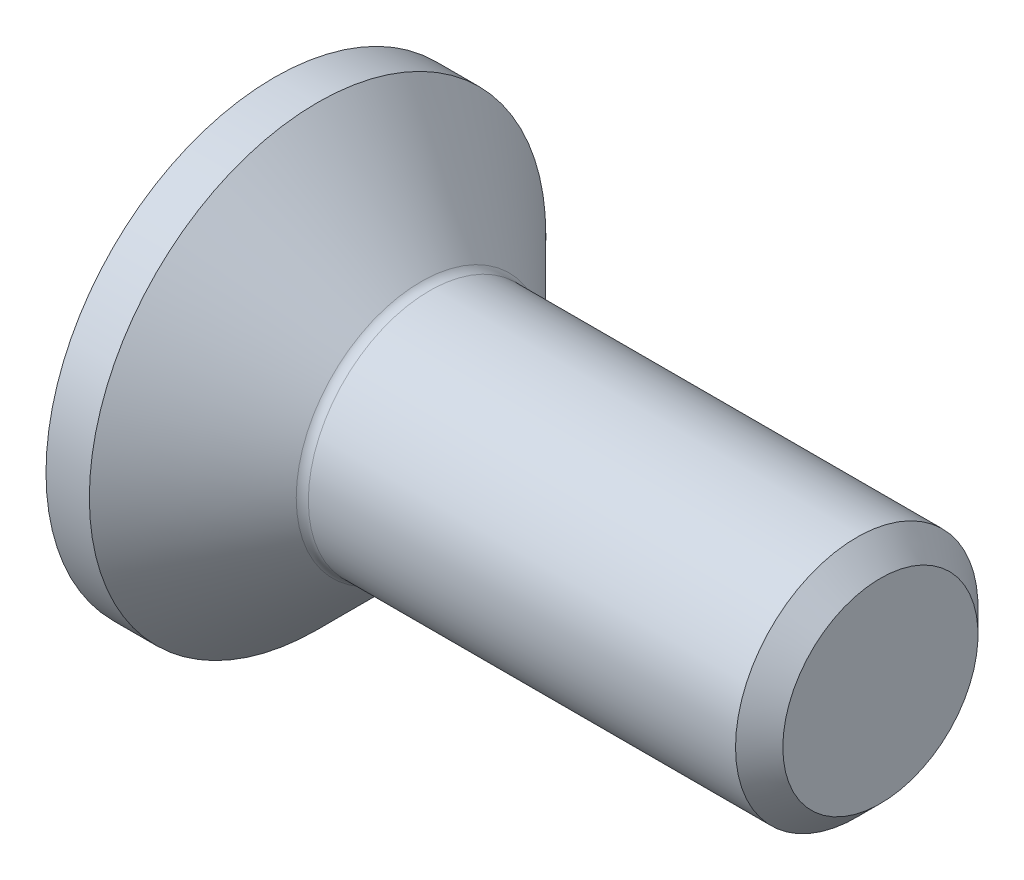
ISO-10303-21;
HEADER;
FILE_DESCRIPTION(('STEP AP214'),'2;1');
FILE_NAME('part.step','',(''),(''),'','','');
FILE_SCHEMA(('AUTOMOTIVE_DESIGN { 1 0 10303 214 1 1 1 1 }'));
ENDSEC;
DATA;
#1=APPLICATION_CONTEXT('core data for automotive mechanical design processes');
#2=APPLICATION_PROTOCOL_DEFINITION('international standard','automotive_design',2000,#1);
#3=PRODUCT_CONTEXT('',#1,'mechanical');
#4=PRODUCT('Part','Part','',(#3));
#5=PRODUCT_RELATED_PRODUCT_CATEGORY('part','',(#4));
#6=PRODUCT_DEFINITION_FORMATION('','',#4);
#7=PRODUCT_DEFINITION_CONTEXT('part definition',#1,'design');
#8=PRODUCT_DEFINITION('design','',#6,#7);
#9=PRODUCT_DEFINITION_SHAPE('','',#8);
#10=(LENGTH_UNIT() NAMED_UNIT(*) SI_UNIT(.MILLI.,.METRE.));
#11=(NAMED_UNIT(*) PLANE_ANGLE_UNIT() SI_UNIT($,.RADIAN.));
#12=(NAMED_UNIT(*) SI_UNIT($,.STERADIAN.) SOLID_ANGLE_UNIT());
#13=UNCERTAINTY_MEASURE_WITH_UNIT(LENGTH_MEASURE(1.E-05),#10,'distance_accuracy_value','');
#14=(GEOMETRIC_REPRESENTATION_CONTEXT(3) GLOBAL_UNCERTAINTY_ASSIGNED_CONTEXT((#13)) GLOBAL_UNIT_ASSIGNED_CONTEXT((#10,
#11,#12)) REPRESENTATION_CONTEXT('',''));
#15=CARTESIAN_POINT('',(0.,0.,0.));
#16=DIRECTION('',(0.,0.,1.));
#17=DIRECTION('',(1.,0.,0.));
#18=AXIS2_PLACEMENT_3D('',#15,#16,#17);
#19=CARTESIAN_POINT('',(0.,0.,0.));
#20=DIRECTION('',(-1.,0.,0.));
#21=DIRECTION('',(0.,0.,1.));
#22=AXIS2_PLACEMENT_3D('',#19,#20,#21);
#23=PLANE('',#22);
#24=CARTESIAN_POINT('',(0.,0.,0.));
#25=DIRECTION('',(-1.,0.,0.));
#26=DIRECTION('',(0.,0.,1.));
#27=AXIS2_PLACEMENT_3D('',#24,#25,#26);
#28=CIRCLE('',#27,3.765);
#29=CARTESIAN_POINT('',(0.,0.,3.765));
#30=VERTEX_POINT('',#29);
#31=EDGE_CURVE('E167',#30,#30,#28,.T.);
#32=ORIENTED_EDGE('',*,*,#31,.T.);
#33=EDGE_LOOP('',(#32));
#34=FACE_BOUND('',#33,.T.);
#35=DIRECTION('',(0.,-0.500000000000001,-0.866025403784438));
#36=VECTOR('',#35,1.);
#37=CARTESIAN_POINT('',(0.,-0.721687836487031,1.25));
#38=LINE('',#37,#36);
#39=CARTESIAN_POINT('',(0.,-0.721687836487031,1.25));
#40=VERTEX_POINT('',#39);
#41=CARTESIAN_POINT('',(0.,-1.44337567297407,0.));
#42=VERTEX_POINT('',#41);
#43=EDGE_CURVE('E123',#40,#42,#38,.T.);
#44=ORIENTED_EDGE('',*,*,#43,.T.);
#45=DIRECTION('',(0.,0.5,-0.866025403784438));
#46=VECTOR('',#45,1.);
#47=CARTESIAN_POINT('',(0.,-1.44337567297407,0.));
#48=LINE('',#47,#46);
#49=CARTESIAN_POINT('',(0.,-0.721687836487032,-1.25));
#50=VERTEX_POINT('',#49);
#51=EDGE_CURVE('E41',#42,#50,#48,.T.);
#52=ORIENTED_EDGE('',*,*,#51,.T.);
#53=DIRECTION('',(0.,1.,0.));
#54=VECTOR('',#53,1.);
#55=CARTESIAN_POINT('',(0.,-0.721687836487032,-1.25));
#56=LINE('',#55,#54);
#57=CARTESIAN_POINT('',(0.,0.721687836487033,-1.25));
#58=VERTEX_POINT('',#57);
#59=EDGE_CURVE('E104',#50,#58,#56,.T.);
#60=ORIENTED_EDGE('',*,*,#59,.T.);
#61=DIRECTION('',(0.,0.500000000000001,0.866025403784438));
#62=VECTOR('',#61,1.);
#63=CARTESIAN_POINT('',(0.,0.721687836487033,-1.25));
#64=LINE('',#63,#62);
#65=CARTESIAN_POINT('',(0.,1.44337567297407,0.));
#66=VERTEX_POINT('',#65);
#67=EDGE_CURVE('E112',#58,#66,#64,.T.);
#68=ORIENTED_EDGE('',*,*,#67,.T.);
#69=DIRECTION('',(0.,-0.5,0.866025403784439));
#70=VECTOR('',#69,1.);
#71=CARTESIAN_POINT('',(0.,1.44337567297407,0.));
#72=LINE('',#71,#70);
#73=CARTESIAN_POINT('',(0.,0.721687836487033,1.25));
#74=VERTEX_POINT('',#73);
#75=EDGE_CURVE('E127',#66,#74,#72,.T.);
#76=ORIENTED_EDGE('',*,*,#75,.T.);
#77=DIRECTION('',(0.,-1.,0.));
#78=VECTOR('',#77,1.);
#79=CARTESIAN_POINT('',(0.,0.721687836487033,1.25));
#80=LINE('',#79,#78);
#81=EDGE_CURVE('E130',#74,#40,#80,.T.);
#82=ORIENTED_EDGE('',*,*,#81,.T.);
#83=EDGE_LOOP('',(#44,#52,#60,#68,#76,#82));
#84=FACE_BOUND('',#83,.T.);
#85=ADVANCED_FACE('F26',(#34,#84),#23,.T.);
#86=CARTESIAN_POINT('',(9.99999999999999,1.61,0.));
#87=DIRECTION('',(1.,0.,0.));
#88=DIRECTION('',(0.,0.,-1.));
#89=AXIS2_PLACEMENT_3D('',#86,#87,#88);
#90=PLANE('',#89);
#91=CARTESIAN_POINT('',(9.99999999999999,0.,0.));
#92=DIRECTION('',(-1.,0.,0.));
#93=DIRECTION('',(0.,0.,1.));
#94=AXIS2_PLACEMENT_3D('',#91,#92,#93);
#95=CIRCLE('',#94,1.61);
#96=CARTESIAN_POINT('',(9.99999999999999,0.,1.61));
#97=VERTEX_POINT('',#96);
#98=EDGE_CURVE('E177',#97,#97,#95,.T.);
#99=ORIENTED_EDGE('',*,*,#98,.F.);
#100=EDGE_LOOP('',(#99));
#101=FACE_BOUND('',#100,.T.);
#102=ADVANCED_FACE('F28',(#101),#90,.T.);
#103=CARTESIAN_POINT('',(9.99999999999999,0.,0.));
#104=DIRECTION('',(-1.,0.,0.));
#105=DIRECTION('',(0.,0.,1.));
#106=AXIS2_PLACEMENT_3D('',#103,#104,#105);
#107=CONICAL_SURFACE('',#106,1.61,0.785398163397446);
#108=CARTESIAN_POINT('',(9.60999999999999,0.,0.));
#109=DIRECTION('',(-1.,0.,0.));
#110=DIRECTION('',(0.,0.,1.));
#111=AXIS2_PLACEMENT_3D('',#108,#109,#110);
#112=CIRCLE('',#111,2.);
#113=CARTESIAN_POINT('',(9.60999999999999,0.,2.));
#114=VERTEX_POINT('',#113);
#115=EDGE_CURVE('E174',#114,#114,#112,.T.);
#116=ORIENTED_EDGE('',*,*,#115,.F.);
#117=EDGE_LOOP('',(#116));
#118=FACE_BOUND('',#117,.T.);
#119=ORIENTED_EDGE('',*,*,#98,.T.);
#120=EDGE_LOOP('',(#119));
#121=FACE_BOUND('',#120,.T.);
#122=ADVANCED_FACE('F206',(#118,#121),#107,.T.);
#123=CARTESIAN_POINT('',(0.,0.,0.));
#124=DIRECTION('',(-1.,0.,0.));
#125=DIRECTION('',(0.,0.,1.));
#126=AXIS2_PLACEMENT_3D('',#123,#124,#125);
#127=CYLINDRICAL_SURFACE('',#126,2.);
#128=CARTESIAN_POINT('',(2.56284271247462,0.,0.));
#129=DIRECTION('',(-1.,0.,0.));
#130=DIRECTION('',(0.,0.,1.));
#131=AXIS2_PLACEMENT_3D('',#128,#129,#130);
#132=CIRCLE('',#131,2.);
#133=CARTESIAN_POINT('',(2.56284271247462,0.,2.));
#134=VERTEX_POINT('',#133);
#135=EDGE_CURVE('E11',#134,#134,#132,.F.);
#136=ORIENTED_EDGE('',*,*,#135,.T.);
#137=EDGE_LOOP('',(#136));
#138=FACE_BOUND('',#137,.T.);
#139=ORIENTED_EDGE('',*,*,#115,.T.);
#140=EDGE_LOOP('',(#139));
#141=FACE_BOUND('',#140,.T.);
#142=ADVANCED_FACE('F210',(#138,#141),#127,.T.);
#143=CARTESIAN_POINT('',(0.71500000000001,0.,0.));
#144=DIRECTION('',(-1.,0.,0.));
#145=DIRECTION('',(0.,0.,1.));
#146=AXIS2_PLACEMENT_3D('',#143,#144,#145);
#147=CONICAL_SURFACE('',#146,3.765,0.785398163397451);
#148=CARTESIAN_POINT('',(2.42142135623731,0.,0.));
#149=DIRECTION('',(-1.,0.,0.));
#150=DIRECTION('',(0.,0.,1.));
#151=AXIS2_PLACEMENT_3D('',#148,#149,#150);
#152=CIRCLE('',#151,2.05857864376269);
#153=CARTESIAN_POINT('',(2.42142135623731,0.,2.05857864376269));
#154=VERTEX_POINT('',#153);
#155=EDGE_CURVE('E34',#154,#154,#152,.T.);
#156=ORIENTED_EDGE('',*,*,#155,.T.);
#157=EDGE_LOOP('',(#156));
#158=FACE_BOUND('',#157,.T.);
#159=CARTESIAN_POINT('',(0.71500000000001,0.,0.));
#160=DIRECTION('',(-1.,0.,0.));
#161=DIRECTION('',(0.,0.,1.));
#162=AXIS2_PLACEMENT_3D('',#159,#160,#161);
#163=CIRCLE('',#162,3.765);
#164=CARTESIAN_POINT('',(0.71500000000001,0.,3.765));
#165=VERTEX_POINT('',#164);
#166=EDGE_CURVE('E171',#165,#165,#163,.T.);
#167=ORIENTED_EDGE('',*,*,#166,.F.);
#168=EDGE_LOOP('',(#167));
#169=FACE_BOUND('',#168,.T.);
#170=ADVANCED_FACE('F182',(#158,#169),#147,.T.);
#171=CARTESIAN_POINT('',(0.,0.,0.));
#172=DIRECTION('',(-1.,0.,0.));
#173=DIRECTION('',(0.,0.,1.));
#174=AXIS2_PLACEMENT_3D('',#171,#172,#173);
#175=CYLINDRICAL_SURFACE('',#174,3.765);
#176=ORIENTED_EDGE('',*,*,#166,.T.);
#177=EDGE_LOOP('',(#176));
#178=FACE_BOUND('',#177,.T.);
#179=ORIENTED_EDGE('',*,*,#31,.F.);
#180=EDGE_LOOP('',(#179));
#181=FACE_BOUND('',#180,.T.);
#182=ADVANCED_FACE('F187',(#178,#181),#175,.T.);
#183=CARTESIAN_POINT('',(2.56284271247462,0.,0.));
#184=DIRECTION('',(-1.,0.,0.));
#185=DIRECTION('',(0.,0.,1.));
#186=AXIS2_PLACEMENT_3D('',#183,#184,#185);
#187=TOROIDAL_SURFACE('',#186,2.2,0.2);
#188=ORIENTED_EDGE('',*,*,#135,.F.);
#189=EDGE_LOOP('',(#188));
#190=FACE_BOUND('',#189,.T.);
#191=ORIENTED_EDGE('',*,*,#155,.F.);
#192=EDGE_LOOP('',(#191));
#193=FACE_BOUND('',#192,.T.);
#194=ADVANCED_FACE('F185',(#190,#193),#187,.F.);
#195=CARTESIAN_POINT('',(1.5,-1.44337567297407,0.));
#196=DIRECTION('',(0.,0.866025403784438,0.500000000000001));
#197=DIRECTION('',(0.,-0.500000000000001,0.866025403784438));
#198=AXIS2_PLACEMENT_3D('',#195,#196,#197);
#199=PLANE('',#198);
#200=ORIENTED_EDGE('',*,*,#51,.F.);
#201=DIRECTION('',(-1.,0.,0.));
#202=VECTOR('',#201,1.);
#203=CARTESIAN_POINT('',(1.5,-1.44337567297407,0.));
#204=LINE('',#203,#202);
#205=CARTESIAN_POINT('',(1.5,-1.44337567297407,0.));
#206=VERTEX_POINT('',#205);
#207=EDGE_CURVE('E152',#206,#42,#204,.T.);
#208=ORIENTED_EDGE('',*,*,#207,.F.);
#209=DIRECTION('',(0.,0.5,-0.866025403784438));
#210=VECTOR('',#209,1.);
#211=CARTESIAN_POINT('',(1.5,-1.44337567297407,0.));
#212=LINE('',#211,#210);
#213=CARTESIAN_POINT('',(1.5,-1.08253175473055,-0.625000000000001));
#214=VERTEX_POINT('',#213);
#215=EDGE_CURVE('E133',#206,#214,#212,.T.);
#216=ORIENTED_EDGE('',*,*,#215,.T.);
#217=CARTESIAN_POINT('',(1.5,-0.721687836487032,-1.25));
#218=VERTEX_POINT('',#217);
#219=EDGE_CURVE('E117',#214,#218,#212,.T.);
#220=ORIENTED_EDGE('',*,*,#219,.T.);
#221=DIRECTION('',(-1.,0.,0.));
#222=VECTOR('',#221,1.);
#223=CARTESIAN_POINT('',(1.5,-0.721687836487032,-1.25));
#224=LINE('',#223,#222);
#225=EDGE_CURVE('E107',#218,#50,#224,.T.);
#226=ORIENTED_EDGE('',*,*,#225,.T.);
#227=EDGE_LOOP('',(#200,#208,#216,#220,#226));
#228=FACE_BOUND('',#227,.T.);
#229=ADVANCED_FACE('F114',(#228),#199,.T.);
#230=CARTESIAN_POINT('',(1.5,-0.721687836487032,-1.25));
#231=DIRECTION('',(0.,0.,1.));
#232=DIRECTION('',(0.,-1.,0.));
#233=AXIS2_PLACEMENT_3D('',#230,#231,#232);
#234=PLANE('',#233);
#235=ORIENTED_EDGE('',*,*,#59,.F.);
#236=ORIENTED_EDGE('',*,*,#225,.F.);
#237=DIRECTION('',(0.,1.,0.));
#238=VECTOR('',#237,1.);
#239=CARTESIAN_POINT('',(1.5,-0.721687836487032,-1.25));
#240=LINE('',#239,#238);
#241=CARTESIAN_POINT('',(1.5,0.,-1.25));
#242=VERTEX_POINT('',#241);
#243=EDGE_CURVE('E136',#218,#242,#240,.T.);
#244=ORIENTED_EDGE('',*,*,#243,.T.);
#245=CARTESIAN_POINT('',(1.5,0.721687836487033,-1.25));
#246=VERTEX_POINT('',#245);
#247=EDGE_CURVE('E135',#242,#246,#240,.T.);
#248=ORIENTED_EDGE('',*,*,#247,.T.);
#249=DIRECTION('',(-1.,0.,0.));
#250=VECTOR('',#249,1.);
#251=CARTESIAN_POINT('',(1.5,0.721687836487033,-1.25));
#252=LINE('',#251,#250);
#253=EDGE_CURVE('E109',#246,#58,#252,.T.);
#254=ORIENTED_EDGE('',*,*,#253,.T.);
#255=EDGE_LOOP('',(#235,#236,#244,#248,#254));
#256=FACE_BOUND('',#255,.T.);
#257=ADVANCED_FACE('F105',(#256),#234,.T.);
#258=CARTESIAN_POINT('',(1.5,0.721687836487033,-1.25));
#259=DIRECTION('',(0.,-0.866025403784438,0.5));
#260=DIRECTION('',(0.,-0.500000000000001,-0.866025403784438));
#261=AXIS2_PLACEMENT_3D('',#258,#259,#260);
#262=PLANE('',#261);
#263=ORIENTED_EDGE('',*,*,#67,.F.);
#264=ORIENTED_EDGE('',*,*,#253,.F.);
#265=DIRECTION('',(0.,0.500000000000001,0.866025403784438));
#266=VECTOR('',#265,1.);
#267=CARTESIAN_POINT('',(1.5,0.721687836487033,-1.25));
#268=LINE('',#267,#266);
#269=CARTESIAN_POINT('',(1.5,1.08253175473055,-0.625000000000001));
#270=VERTEX_POINT('',#269);
#271=EDGE_CURVE('E139',#246,#270,#268,.T.);
#272=ORIENTED_EDGE('',*,*,#271,.T.);
#273=CARTESIAN_POINT('',(1.5,1.44337567297407,0.));
#274=VERTEX_POINT('',#273);
#275=EDGE_CURVE('E138',#270,#274,#268,.T.);
#276=ORIENTED_EDGE('',*,*,#275,.T.);
#277=DIRECTION('',(-1.,0.,0.));
#278=VECTOR('',#277,1.);
#279=CARTESIAN_POINT('',(1.5,1.44337567297407,0.));
#280=LINE('',#279,#278);
#281=EDGE_CURVE('E160',#274,#66,#280,.T.);
#282=ORIENTED_EDGE('',*,*,#281,.T.);
#283=EDGE_LOOP('',(#263,#264,#272,#276,#282));
#284=FACE_BOUND('',#283,.T.);
#285=ADVANCED_FACE('F259',(#284),#262,.T.);
#286=CARTESIAN_POINT('',(1.5,1.44337567297407,0.));
#287=DIRECTION('',(0.,-0.866025403784439,-0.5));
#288=DIRECTION('',(0.,0.5,-0.866025403784439));
#289=AXIS2_PLACEMENT_3D('',#286,#287,#288);
#290=PLANE('',#289);
#291=ORIENTED_EDGE('',*,*,#75,.F.);
#292=ORIENTED_EDGE('',*,*,#281,.F.);
#293=DIRECTION('',(0.,-0.5,0.866025403784439));
#294=VECTOR('',#293,1.);
#295=CARTESIAN_POINT('',(1.5,1.44337567297407,0.));
#296=LINE('',#295,#294);
#297=CARTESIAN_POINT('',(1.5,1.08253175473055,0.625));
#298=VERTEX_POINT('',#297);
#299=EDGE_CURVE('E49',#274,#298,#296,.T.);
#300=ORIENTED_EDGE('',*,*,#299,.T.);
#301=CARTESIAN_POINT('',(1.5,0.721687836487033,1.25));
#302=VERTEX_POINT('',#301);
#303=EDGE_CURVE('E142',#298,#302,#296,.T.);
#304=ORIENTED_EDGE('',*,*,#303,.T.);
#305=DIRECTION('',(-1.,0.,0.));
#306=VECTOR('',#305,1.);
#307=CARTESIAN_POINT('',(1.5,0.721687836487033,1.25));
#308=LINE('',#307,#306);
#309=EDGE_CURVE('E157',#302,#74,#308,.T.);
#310=ORIENTED_EDGE('',*,*,#309,.T.);
#311=EDGE_LOOP('',(#291,#292,#300,#304,#310));
#312=FACE_BOUND('',#311,.T.);
#313=ADVANCED_FACE('F266',(#312),#290,.T.);
#314=CARTESIAN_POINT('',(1.5,0.721687836487033,1.25));
#315=DIRECTION('',(0.,0.,-1.));
#316=DIRECTION('',(0.,1.,0.));
#317=AXIS2_PLACEMENT_3D('',#314,#315,#316);
#318=PLANE('',#317);
#319=ORIENTED_EDGE('',*,*,#81,.F.);
#320=ORIENTED_EDGE('',*,*,#309,.F.);
#321=DIRECTION('',(0.,-1.,0.));
#322=VECTOR('',#321,1.);
#323=CARTESIAN_POINT('',(1.5,0.721687836487033,1.25));
#324=LINE('',#323,#322);
#325=CARTESIAN_POINT('',(1.5,0.,1.25));
#326=VERTEX_POINT('',#325);
#327=EDGE_CURVE('E145',#302,#326,#324,.T.);
#328=ORIENTED_EDGE('',*,*,#327,.T.);
#329=CARTESIAN_POINT('',(1.5,-0.721687836487031,1.25));
#330=VERTEX_POINT('',#329);
#331=EDGE_CURVE('E144',#326,#330,#324,.T.);
#332=ORIENTED_EDGE('',*,*,#331,.T.);
#333=DIRECTION('',(-1.,0.,0.));
#334=VECTOR('',#333,1.);
#335=CARTESIAN_POINT('',(1.5,-0.721687836487031,1.25));
#336=LINE('',#335,#334);
#337=EDGE_CURVE('E154',#330,#40,#336,.T.);
#338=ORIENTED_EDGE('',*,*,#337,.T.);
#339=EDGE_LOOP('',(#319,#320,#328,#332,#338));
#340=FACE_BOUND('',#339,.T.);
#341=ADVANCED_FACE('F274',(#340),#318,.T.);
#342=CARTESIAN_POINT('',(1.5,-0.721687836487031,1.25));
#343=DIRECTION('',(0.,0.866025403784438,-0.500000000000001));
#344=DIRECTION('',(0.,0.500000000000001,0.866025403784438));
#345=AXIS2_PLACEMENT_3D('',#342,#343,#344);
#346=PLANE('',#345);
#347=ORIENTED_EDGE('',*,*,#43,.F.);
#348=ORIENTED_EDGE('',*,*,#337,.F.);
#349=DIRECTION('',(0.,-0.500000000000001,-0.866025403784438));
#350=VECTOR('',#349,1.);
#351=CARTESIAN_POINT('',(1.5,-0.721687836487031,1.25));
#352=LINE('',#351,#350);
#353=CARTESIAN_POINT('',(1.5,-1.08253175473055,0.625000000000002));
#354=VERTEX_POINT('',#353);
#355=EDGE_CURVE('E149',#330,#354,#352,.T.);
#356=ORIENTED_EDGE('',*,*,#355,.T.);
#357=EDGE_CURVE('E148',#354,#206,#352,.T.);
#358=ORIENTED_EDGE('',*,*,#357,.T.);
#359=ORIENTED_EDGE('',*,*,#207,.T.);
#360=EDGE_LOOP('',(#347,#348,#356,#358,#359));
#361=FACE_BOUND('',#360,.T.);
#362=ADVANCED_FACE('F281',(#361),#346,.T.);
#363=CARTESIAN_POINT('',(1.5,-1.44337567297407,0.));
#364=DIRECTION('',(-1.,0.,0.));
#365=DIRECTION('',(0.,0.,1.));
#366=AXIS2_PLACEMENT_3D('',#363,#364,#365);
#367=PLANE('',#366);
#368=CARTESIAN_POINT('',(1.5,0.,0.));
#369=DIRECTION('',(-1.,0.,0.));
#370=DIRECTION('',(0.,0.,1.));
#371=AXIS2_PLACEMENT_3D('',#368,#369,#370);
#372=CIRCLE('',#371,1.25);
#373=EDGE_CURVE('E119',#354,#326,#372,.T.);
#374=ORIENTED_EDGE('',*,*,#373,.F.);
#375=ORIENTED_EDGE('',*,*,#355,.F.);
#376=ORIENTED_EDGE('',*,*,#331,.F.);
#377=EDGE_LOOP('',(#374,#375,#376));
#378=FACE_BOUND('',#377,.T.);
#379=ADVANCED_FACE('F289',(#378),#367,.T.);
#380=EDGE_CURVE('E344',#214,#354,#372,.T.);
#381=ORIENTED_EDGE('',*,*,#380,.F.);
#382=ORIENTED_EDGE('',*,*,#215,.F.);
#383=ORIENTED_EDGE('',*,*,#357,.F.);
#384=EDGE_LOOP('',(#381,#382,#383));
#385=FACE_BOUND('',#384,.T.);
#386=ADVANCED_FACE('F297',(#385),#367,.T.);
#387=EDGE_CURVE('E345',#242,#214,#372,.T.);
#388=ORIENTED_EDGE('',*,*,#387,.F.);
#389=ORIENTED_EDGE('',*,*,#243,.F.);
#390=ORIENTED_EDGE('',*,*,#219,.F.);
#391=EDGE_LOOP('',(#388,#389,#390));
#392=FACE_BOUND('',#391,.T.);
#393=ADVANCED_FACE('F305',(#392),#367,.T.);
#394=EDGE_CURVE('E346',#270,#242,#372,.T.);
#395=ORIENTED_EDGE('',*,*,#394,.F.);
#396=ORIENTED_EDGE('',*,*,#271,.F.);
#397=ORIENTED_EDGE('',*,*,#247,.F.);
#398=EDGE_LOOP('',(#395,#396,#397));
#399=FACE_BOUND('',#398,.T.);
#400=ADVANCED_FACE('F312',(#399),#367,.T.);
#401=EDGE_CURVE('E168',#298,#270,#372,.T.);
#402=ORIENTED_EDGE('',*,*,#401,.F.);
#403=ORIENTED_EDGE('',*,*,#299,.F.);
#404=ORIENTED_EDGE('',*,*,#275,.F.);
#405=EDGE_LOOP('',(#402,#403,#404));
#406=FACE_BOUND('',#405,.T.);
#407=ADVANCED_FACE('F319',(#406),#367,.T.);
#408=EDGE_CURVE('E164',#326,#298,#372,.T.);
#409=ORIENTED_EDGE('',*,*,#408,.F.);
#410=ORIENTED_EDGE('',*,*,#327,.F.);
#411=ORIENTED_EDGE('',*,*,#303,.F.);
#412=EDGE_LOOP('',(#409,#410,#411));
#413=FACE_BOUND('',#412,.T.);
#414=ADVANCED_FACE('F244',(#413),#367,.T.);
#415=CARTESIAN_POINT('',(1.5,0.,0.));
#416=DIRECTION('',(-1.,0.,0.));
#417=DIRECTION('',(0.,0.,1.));
#418=AXIS2_PLACEMENT_3D('',#415,#416,#417);
#419=CONICAL_SURFACE('',#418,1.25,1.04719755119659);
#420=CARTESIAN_POINT('',(2.22168783648704,0.,0.));
#421=VERTEX_POINT('',#420);
#422=VERTEX_LOOP('',#421);
#423=FACE_BOUND('',#422,.T.);
#424=ORIENTED_EDGE('',*,*,#408,.T.);
#425=ORIENTED_EDGE('',*,*,#401,.T.);
#426=ORIENTED_EDGE('',*,*,#394,.T.);
#427=ORIENTED_EDGE('',*,*,#387,.T.);
#428=ORIENTED_EDGE('',*,*,#380,.T.);
#429=ORIENTED_EDGE('',*,*,#373,.T.);
#430=EDGE_LOOP('',(#424,#425,#426,#427,#428,#429));
#431=FACE_BOUND('',#430,.T.);
#432=ADVANCED_FACE('F240',(#423,#431),#419,.F.);
#433=CLOSED_SHELL('',(#85,#102,#122,#142,#170,#182,#194,#229,#257,#285,#313,#341,#362,#379,#386,
#393,#400,#407,#414,#432));
#434=MANIFOLD_SOLID_BREP('B2',#433);
#435=ADVANCED_BREP_SHAPE_REPRESENTATION('',(#18,#434),#14);
#436=SHAPE_DEFINITION_REPRESENTATION(#9,#435);
ENDSEC;
END-ISO-10303-21;
